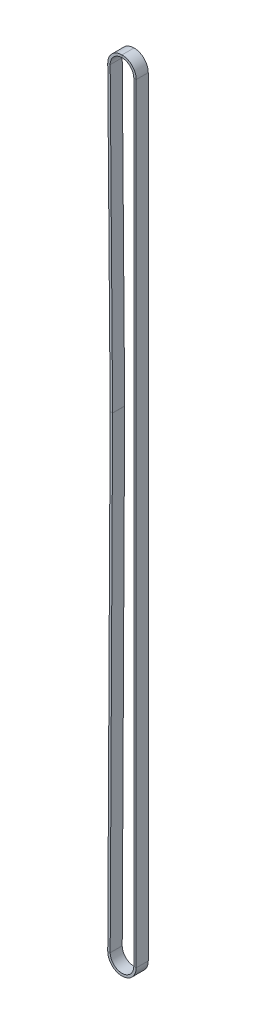
ISO-10303-21;
HEADER;
FILE_DESCRIPTION(('STEP AP214'),'2;1');
FILE_NAME('part.step','',(''),(''),'','','');
FILE_SCHEMA(('AUTOMOTIVE_DESIGN { 1 0 10303 214 1 1 1 1 }'));
ENDSEC;
DATA;
#1=APPLICATION_CONTEXT('core data for automotive mechanical design processes');
#2=APPLICATION_PROTOCOL_DEFINITION('international standard','automotive_design',2000,#1);
#3=PRODUCT_CONTEXT('',#1,'mechanical');
#4=PRODUCT('Part','Part','',(#3));
#5=PRODUCT_RELATED_PRODUCT_CATEGORY('part','',(#4));
#6=PRODUCT_DEFINITION_FORMATION('','',#4);
#7=PRODUCT_DEFINITION_CONTEXT('part definition',#1,'design');
#8=PRODUCT_DEFINITION('design','',#6,#7);
#9=PRODUCT_DEFINITION_SHAPE('','',#8);
#10=(LENGTH_UNIT() NAMED_UNIT(*) SI_UNIT(.MILLI.,.METRE.));
#11=(NAMED_UNIT(*) PLANE_ANGLE_UNIT() SI_UNIT($,.RADIAN.));
#12=(NAMED_UNIT(*) SI_UNIT($,.STERADIAN.) SOLID_ANGLE_UNIT());
#13=UNCERTAINTY_MEASURE_WITH_UNIT(LENGTH_MEASURE(1.E-05),#10,'distance_accuracy_value','');
#14=(GEOMETRIC_REPRESENTATION_CONTEXT(3) GLOBAL_UNCERTAINTY_ASSIGNED_CONTEXT((#13)) GLOBAL_UNIT_ASSIGNED_CONTEXT((#10,
#11,#12)) REPRESENTATION_CONTEXT('',''));
#15=CARTESIAN_POINT('',(0.,0.,0.));
#16=DIRECTION('',(0.,0.,1.));
#17=DIRECTION('',(1.,0.,0.));
#18=AXIS2_PLACEMENT_3D('',#15,#16,#17);
#19=CARTESIAN_POINT('',(-8.7177703192538,470.591298965353,0.));
#20=DIRECTION('',(0.,0.,1.));
#21=DIRECTION('',(1.,0.,0.));
#22=AXIS2_PLACEMENT_3D('',#19,#20,#21);
#23=PLANE('',#22);
#24=CARTESIAN_POINT('',(0.,470.661999990804,0.));
#25=DIRECTION('',(0.,0.,-1.));
#26=DIRECTION('',(-0.999967115657576,-0.00810972277375304,0.));
#27=AXIS2_PLACEMENT_3D('',#24,#25,#26);
#28=CIRCLE('',#27,7.2180570068257);
#29=CARTESIAN_POINT('',(-7.21781964576745,470.603463549513,0.));
#30=VERTEX_POINT('',#29);
#31=CARTESIAN_POINT('',(0.,477.88005699763,0.));
#32=VERTEX_POINT('',#31);
#33=EDGE_CURVE('E188',#30,#32,#28,.T.);
#34=ORIENTED_EDGE('',*,*,#33,.T.);
#35=DIRECTION('',(0.,-1.,0.));
#36=VECTOR('',#35,1.);
#37=CARTESIAN_POINT('',(0.,479.38005699763,0.));
#38=LINE('',#37,#36);
#39=CARTESIAN_POINT('',(0.,479.38005699763,0.));
#40=VERTEX_POINT('',#39);
#41=EDGE_CURVE('E162',#40,#32,#38,.T.);
#42=ORIENTED_EDGE('',*,*,#41,.F.);
#43=CARTESIAN_POINT('',(0.,470.661999990804,0.));
#44=DIRECTION('',(0.,0.,-1.));
#45=DIRECTION('',(-0.999967115657576,-0.00810972277374851,0.));
#46=AXIS2_PLACEMENT_3D('',#43,#44,#45);
#47=CIRCLE('',#46,8.71805700682568);
#48=CARTESIAN_POINT('',(-8.71777031924597,470.591298964389,0.));
#49=VERTEX_POINT('',#48);
#50=EDGE_CURVE('E189',#49,#40,#47,.T.);
#51=ORIENTED_EDGE('',*,*,#50,.F.);
#52=DIRECTION('',(0.999967115647156,0.00810972405866235,0.));
#53=VECTOR('',#52,1.);
#54=CARTESIAN_POINT('',(-8.71777031923815,470.591298963425,0.));
#55=LINE('',#54,#53);
#56=EDGE_CURVE('E281',#49,#30,#55,.T.);
#57=ORIENTED_EDGE('',*,*,#56,.T.);
#58=EDGE_LOOP('',(#34,#42,#51,#57));
#59=FACE_BOUND('',#58,.T.);
#60=ADVANCED_FACE('F33',(#59),#23,.T.);
#61=CARTESIAN_POINT('',(0.,470.661999990804,0.));
#62=DIRECTION('',(0.,0.,-1.));
#63=DIRECTION('',(-1.,0.,0.));
#64=AXIS2_PLACEMENT_3D('',#61,#62,#63);
#65=CYLINDRICAL_SURFACE('',#64,7.2180570068257);
#66=CARTESIAN_POINT('',(0.,470.661999990804,-7.366));
#67=DIRECTION('',(0.,0.,-1.));
#68=DIRECTION('',(-0.999967115657576,-0.00810972277375304,0.));
#69=AXIS2_PLACEMENT_3D('',#66,#67,#68);
#70=CIRCLE('',#69,7.2180570068257);
#71=CARTESIAN_POINT('',(-7.21781964576745,470.603463549513,-7.366));
#72=VERTEX_POINT('',#71);
#73=CARTESIAN_POINT('',(0.,477.88005699763,-7.366));
#74=VERTEX_POINT('',#73);
#75=EDGE_CURVE('E197',#72,#74,#70,.T.);
#76=ORIENTED_EDGE('',*,*,#75,.T.);
#77=DIRECTION('',(0.,0.,-1.));
#78=VECTOR('',#77,1.);
#79=CARTESIAN_POINT('',(0.,477.88005699763,0.));
#80=LINE('',#79,#78);
#81=EDGE_CURVE('E192',#32,#74,#80,.T.);
#82=ORIENTED_EDGE('',*,*,#81,.F.);
#83=ORIENTED_EDGE('',*,*,#33,.F.);
#84=DIRECTION('',(0.,0.,-1.));
#85=VECTOR('',#84,1.);
#86=CARTESIAN_POINT('',(-7.21781964576745,470.603463549513,0.));
#87=LINE('',#86,#85);
#88=EDGE_CURVE('E257',#30,#72,#87,.T.);
#89=ORIENTED_EDGE('',*,*,#88,.T.);
#90=EDGE_LOOP('',(#76,#82,#83,#89));
#91=FACE_BOUND('',#90,.T.);
#92=ADVANCED_FACE('F386',(#91),#65,.F.);
#93=CARTESIAN_POINT('',(-8.7177703192538,470.591298965353,-7.366));
#94=DIRECTION('',(0.,0.,-1.));
#95=DIRECTION('',(-1.,0.,0.));
#96=AXIS2_PLACEMENT_3D('',#93,#94,#95);
#97=PLANE('',#96);
#98=CARTESIAN_POINT('',(0.,470.661999990804,-7.366));
#99=DIRECTION('',(0.,0.,-1.));
#100=DIRECTION('',(-0.999967115657576,-0.00810972277374851,0.));
#101=AXIS2_PLACEMENT_3D('',#98,#99,#100);
#102=CIRCLE('',#101,8.71805700682568);
#103=CARTESIAN_POINT('',(-8.71777031924597,470.591298964389,-7.366));
#104=VERTEX_POINT('',#103);
#105=CARTESIAN_POINT('',(0.,479.38005699763,-7.366));
#106=VERTEX_POINT('',#105);
#107=EDGE_CURVE('E203',#104,#106,#102,.T.);
#108=ORIENTED_EDGE('',*,*,#107,.T.);
#109=DIRECTION('',(0.,1.,0.));
#110=VECTOR('',#109,1.);
#111=CARTESIAN_POINT('',(0.,479.38005699763,-7.366));
#112=LINE('',#111,#110);
#113=EDGE_CURVE('E200',#74,#106,#112,.T.);
#114=ORIENTED_EDGE('',*,*,#113,.F.);
#115=ORIENTED_EDGE('',*,*,#75,.F.);
#116=DIRECTION('',(-0.999967115647156,-0.00810972405866235,0.));
#117=VECTOR('',#116,1.);
#118=CARTESIAN_POINT('',(-8.71777031923815,470.591298963425,-7.366));
#119=LINE('',#118,#117);
#120=EDGE_CURVE('E82',#72,#104,#119,.T.);
#121=ORIENTED_EDGE('',*,*,#120,.T.);
#122=EDGE_LOOP('',(#108,#114,#115,#121));
#123=FACE_BOUND('',#122,.T.);
#124=ADVANCED_FACE('F393',(#123),#97,.T.);
#125=CARTESIAN_POINT('',(0.,470.661999990804,0.));
#126=DIRECTION('',(0.,0.,-1.));
#127=DIRECTION('',(-1.,0.,0.));
#128=AXIS2_PLACEMENT_3D('',#125,#126,#127);
#129=CYLINDRICAL_SURFACE('',#128,8.71805700682568);
#130=DIRECTION('',(0.,0.,1.));
#131=VECTOR('',#130,1.);
#132=CARTESIAN_POINT('',(0.,479.38005699763,0.));
#133=LINE('',#132,#131);
#134=EDGE_CURVE('E37',#106,#40,#133,.T.);
#135=ORIENTED_EDGE('',*,*,#134,.F.);
#136=ORIENTED_EDGE('',*,*,#107,.F.);
#137=DIRECTION('',(0.,0.,1.));
#138=VECTOR('',#137,1.);
#139=CARTESIAN_POINT('',(-8.71777031923815,470.591298963425,0.));
#140=LINE('',#139,#138);
#141=EDGE_CURVE('E204',#104,#49,#140,.T.);
#142=ORIENTED_EDGE('',*,*,#141,.T.);
#143=ORIENTED_EDGE('',*,*,#50,.T.);
#144=EDGE_LOOP('',(#135,#136,#142,#143));
#145=FACE_BOUND('',#144,.T.);
#146=ADVANCED_FACE('F390',(#145),#129,.T.);
#147=CARTESIAN_POINT('',(0.,479.38005699763,0.));
#148=DIRECTION('',(0.,0.,1.));
#149=DIRECTION('',(1.,0.,0.));
#150=AXIS2_PLACEMENT_3D('',#147,#148,#149);
#151=PLANE('',#150);
#152=CARTESIAN_POINT('',(0.,470.661999990804,0.));
#153=DIRECTION('',(0.,0.,-1.));
#154=DIRECTION('',(0.,1.,0.));
#155=AXIS2_PLACEMENT_3D('',#152,#153,#154);
#156=CIRCLE('',#155,7.21805700682571);
#157=CARTESIAN_POINT('',(7.21805700682568,470.66200000008,0.));
#158=VERTEX_POINT('',#157);
#159=EDGE_CURVE('E149',#32,#158,#156,.T.);
#160=ORIENTED_EDGE('',*,*,#159,.T.);
#161=DIRECTION('',(-1.,0.,0.));
#162=VECTOR('',#161,1.);
#163=CARTESIAN_POINT('',(8.71805700682565,470.66200000008,0.));
#164=LINE('',#163,#162);
#165=CARTESIAN_POINT('',(8.71805700682568,470.662000001043,0.));
#166=VERTEX_POINT('',#165);
#167=EDGE_CURVE('E155',#166,#158,#164,.T.);
#168=ORIENTED_EDGE('',*,*,#167,.F.);
#169=CARTESIAN_POINT('',(0.,470.661999990804,0.));
#170=DIRECTION('',(0.,0.,-1.));
#171=DIRECTION('',(0.,1.,0.));
#172=AXIS2_PLACEMENT_3D('',#169,#170,#171);
#173=CIRCLE('',#172,8.71805700682571);
#174=EDGE_CURVE('E163',#40,#166,#173,.T.);
#175=ORIENTED_EDGE('',*,*,#174,.F.);
#176=ORIENTED_EDGE('',*,*,#41,.T.);
#177=EDGE_LOOP('',(#160,#168,#175,#176));
#178=FACE_BOUND('',#177,.T.);
#179=ADVANCED_FACE('F160',(#178),#151,.T.);
#180=CARTESIAN_POINT('',(0.,470.661999990804,0.));
#181=DIRECTION('',(0.,0.,-1.));
#182=DIRECTION('',(-1.,0.,0.));
#183=AXIS2_PLACEMENT_3D('',#180,#181,#182);
#184=CYLINDRICAL_SURFACE('',#183,7.21805700682571);
#185=CARTESIAN_POINT('',(0.,470.661999990804,-7.366));
#186=DIRECTION('',(0.,0.,-1.));
#187=DIRECTION('',(0.,1.,0.));
#188=AXIS2_PLACEMENT_3D('',#185,#186,#187);
#189=CIRCLE('',#188,7.21805700682571);
#190=CARTESIAN_POINT('',(7.21805700682568,470.66200000008,-7.366));
#191=VERTEX_POINT('',#190);
#192=EDGE_CURVE('E69',#74,#191,#189,.T.);
#193=ORIENTED_EDGE('',*,*,#192,.T.);
#194=DIRECTION('',(0.,0.,-1.));
#195=VECTOR('',#194,1.);
#196=CARTESIAN_POINT('',(7.21805700682565,470.66200000008,0.));
#197=LINE('',#196,#195);
#198=EDGE_CURVE('E145',#158,#191,#197,.T.);
#199=ORIENTED_EDGE('',*,*,#198,.F.);
#200=ORIENTED_EDGE('',*,*,#159,.F.);
#201=ORIENTED_EDGE('',*,*,#81,.T.);
#202=EDGE_LOOP('',(#193,#199,#200,#201));
#203=FACE_BOUND('',#202,.T.);
#204=ADVANCED_FACE('F147',(#203),#184,.F.);
#205=CARTESIAN_POINT('',(0.,479.38005699763,-7.366));
#206=DIRECTION('',(0.,0.,-1.));
#207=DIRECTION('',(-1.,0.,0.));
#208=AXIS2_PLACEMENT_3D('',#205,#206,#207);
#209=PLANE('',#208);
#210=CARTESIAN_POINT('',(0.,470.661999990804,-7.366));
#211=DIRECTION('',(0.,0.,-1.));
#212=DIRECTION('',(0.,1.,0.));
#213=AXIS2_PLACEMENT_3D('',#210,#211,#212);
#214=CIRCLE('',#213,8.71805700682571);
#215=CARTESIAN_POINT('',(8.71805700682568,470.662000001043,-7.366));
#216=VERTEX_POINT('',#215);
#217=EDGE_CURVE('E73',#106,#216,#214,.T.);
#218=ORIENTED_EDGE('',*,*,#217,.T.);
#219=DIRECTION('',(1.,0.,0.));
#220=VECTOR('',#219,1.);
#221=CARTESIAN_POINT('',(8.71805700682565,470.66200000008,-7.366));
#222=LINE('',#221,#220);
#223=EDGE_CURVE('E154',#191,#216,#222,.T.);
#224=ORIENTED_EDGE('',*,*,#223,.F.);
#225=ORIENTED_EDGE('',*,*,#192,.F.);
#226=ORIENTED_EDGE('',*,*,#113,.T.);
#227=EDGE_LOOP('',(#218,#224,#225,#226));
#228=FACE_BOUND('',#227,.T.);
#229=ADVANCED_FACE('F397',(#228),#209,.T.);
#230=CARTESIAN_POINT('',(0.,470.661999990804,0.));
#231=DIRECTION('',(0.,0.,-1.));
#232=DIRECTION('',(-1.,0.,0.));
#233=AXIS2_PLACEMENT_3D('',#230,#231,#232);
#234=CYLINDRICAL_SURFACE('',#233,8.71805700682571);
#235=DIRECTION('',(0.,0.,1.));
#236=VECTOR('',#235,1.);
#237=CARTESIAN_POINT('',(8.71805700682565,470.66200000008,0.));
#238=LINE('',#237,#236);
#239=EDGE_CURVE('E52',#216,#166,#238,.T.);
#240=ORIENTED_EDGE('',*,*,#239,.F.);
#241=ORIENTED_EDGE('',*,*,#217,.F.);
#242=ORIENTED_EDGE('',*,*,#134,.T.);
#243=ORIENTED_EDGE('',*,*,#174,.T.);
#244=EDGE_LOOP('',(#240,#241,#242,#243));
#245=FACE_BOUND('',#244,.T.);
#246=ADVANCED_FACE('F35',(#245),#234,.T.);
#247=CARTESIAN_POINT('',(8.71805700682565,1.51755995553002E-12,0.));
#248=DIRECTION('',(0.,0.,1.));
#249=DIRECTION('',(1.,0.,0.));
#250=AXIS2_PLACEMENT_3D('',#247,#248,#249);
#251=PLANE('',#250);
#252=CARTESIAN_POINT('',(0.,0.,0.));
#253=DIRECTION('',(0.,0.,-1.));
#254=DIRECTION('',(1.,1.73409178692898E-13,0.));
#255=AXIS2_PLACEMENT_3D('',#252,#253,#254);
#256=CIRCLE('',#255,7.21805700682565);
#257=CARTESIAN_POINT('',(7.21805700682565,1.4432899320127E-12,0.));
#258=VERTEX_POINT('',#257);
#259=CARTESIAN_POINT('',(-7.21795942082731,0.0375333594966495,0.));
#260=VERTEX_POINT('',#259);
#261=EDGE_CURVE('E277',#258,#260,#256,.T.);
#262=ORIENTED_EDGE('',*,*,#261,.T.);
#263=DIRECTION('',(0.999986480295425,-0.00519992561171665,0.));
#264=VECTOR('',#263,1.);
#265=CARTESIAN_POINT('',(-8.7179391412705,0.0453332479142263,0.));
#266=LINE('',#265,#264);
#267=CARTESIAN_POINT('',(-8.71793914127045,0.0453332479142241,0.));
#268=VERTEX_POINT('',#267);
#269=EDGE_CURVE('E301',#268,#260,#266,.T.);
#270=ORIENTED_EDGE('',*,*,#269,.F.);
#271=CARTESIAN_POINT('',(0.,0.,0.));
#272=DIRECTION('',(0.,0.,-1.));
#273=DIRECTION('',(1.,1.74070891523406E-13,0.));
#274=AXIS2_PLACEMENT_3D('',#271,#272,#273);
#275=CIRCLE('',#274,8.71805700682565);
#276=CARTESIAN_POINT('',(8.71805700682565,1.4432899320127E-12,0.));
#277=VERTEX_POINT('',#276);
#278=EDGE_CURVE('E231',#277,#268,#275,.T.);
#279=ORIENTED_EDGE('',*,*,#278,.F.);
#280=DIRECTION('',(-1.,0.,0.));
#281=VECTOR('',#280,1.);
#282=CARTESIAN_POINT('',(8.71805700682565,1.35949636541586E-12,0.));
#283=LINE('',#282,#281);
#284=EDGE_CURVE('E172',#277,#258,#283,.T.);
#285=ORIENTED_EDGE('',*,*,#284,.T.);
#286=EDGE_LOOP('',(#262,#270,#279,#285));
#287=FACE_BOUND('',#286,.T.);
#288=ADVANCED_FACE('F307',(#287),#251,.T.);
#289=CARTESIAN_POINT('',(0.,0.,0.));
#290=DIRECTION('',(0.,0.,-1.));
#291=DIRECTION('',(-1.,0.,0.));
#292=AXIS2_PLACEMENT_3D('',#289,#290,#291);
#293=CYLINDRICAL_SURFACE('',#292,7.21805700682565);
#294=CARTESIAN_POINT('',(0.,0.,-7.366));
#295=DIRECTION('',(0.,0.,-1.));
#296=DIRECTION('',(1.,1.73409178692898E-13,0.));
#297=AXIS2_PLACEMENT_3D('',#294,#295,#296);
#298=CIRCLE('',#297,7.21805700682565);
#299=CARTESIAN_POINT('',(7.21805700682565,1.4432899320127E-12,-7.366));
#300=VERTEX_POINT('',#299);
#301=CARTESIAN_POINT('',(-7.21795942082731,0.0375333594966495,-7.366));
#302=VERTEX_POINT('',#301);
#303=EDGE_CURVE('E252',#300,#302,#298,.T.);
#304=ORIENTED_EDGE('',*,*,#303,.T.);
#305=DIRECTION('',(0.,0.,-1.));
#306=VECTOR('',#305,1.);
#307=CARTESIAN_POINT('',(-7.21795942082737,0.0375333594966514,0.));
#308=LINE('',#307,#306);
#309=EDGE_CURVE('E274',#260,#302,#308,.T.);
#310=ORIENTED_EDGE('',*,*,#309,.F.);
#311=ORIENTED_EDGE('',*,*,#261,.F.);
#312=DIRECTION('',(0.,0.,-1.));
#313=VECTOR('',#312,1.);
#314=CARTESIAN_POINT('',(7.21805700682565,1.35959312915985E-12,0.));
#315=LINE('',#314,#313);
#316=EDGE_CURVE('E177',#258,#300,#315,.T.);
#317=ORIENTED_EDGE('',*,*,#316,.T.);
#318=EDGE_LOOP('',(#304,#310,#311,#317));
#319=FACE_BOUND('',#318,.T.);
#320=ADVANCED_FACE('F325',(#319),#293,.F.);
#321=CARTESIAN_POINT('',(8.71805700682565,1.51755995553002E-12,-7.366));
#322=DIRECTION('',(0.,0.,-1.));
#323=DIRECTION('',(-1.,0.,0.));
#324=AXIS2_PLACEMENT_3D('',#321,#322,#323);
#325=PLANE('',#324);
#326=CARTESIAN_POINT('',(0.,0.,-7.366));
#327=DIRECTION('',(0.,0.,-1.));
#328=DIRECTION('',(1.,1.74070891523406E-13,0.));
#329=AXIS2_PLACEMENT_3D('',#326,#327,#328);
#330=CIRCLE('',#329,8.71805700682565);
#331=CARTESIAN_POINT('',(8.71805700682565,1.4432899320127E-12,-7.366));
#332=VERTEX_POINT('',#331);
#333=CARTESIAN_POINT('',(-8.71793914127045,0.0453332479142241,-7.366));
#334=VERTEX_POINT('',#333);
#335=EDGE_CURVE('E226',#332,#334,#330,.T.);
#336=ORIENTED_EDGE('',*,*,#335,.T.);
#337=DIRECTION('',(-0.999986480295425,0.00519992561171665,0.));
#338=VECTOR('',#337,1.);
#339=CARTESIAN_POINT('',(-8.7179391412705,0.0453332479142263,-7.366));
#340=LINE('',#339,#338);
#341=EDGE_CURVE('E249',#302,#334,#340,.T.);
#342=ORIENTED_EDGE('',*,*,#341,.F.);
#343=ORIENTED_EDGE('',*,*,#303,.F.);
#344=DIRECTION('',(1.,0.,0.));
#345=VECTOR('',#344,1.);
#346=CARTESIAN_POINT('',(8.71805700682565,1.35949636541586E-12,-7.366));
#347=LINE('',#346,#345);
#348=EDGE_CURVE('E230',#300,#332,#347,.T.);
#349=ORIENTED_EDGE('',*,*,#348,.T.);
#350=EDGE_LOOP('',(#336,#342,#343,#349));
#351=FACE_BOUND('',#350,.T.);
#352=ADVANCED_FACE('F320',(#351),#325,.T.);
#353=CARTESIAN_POINT('',(0.,0.,0.));
#354=DIRECTION('',(0.,0.,-1.));
#355=DIRECTION('',(-1.,0.,0.));
#356=AXIS2_PLACEMENT_3D('',#353,#354,#355);
#357=CYLINDRICAL_SURFACE('',#356,8.71805700682565);
#358=DIRECTION('',(0.,0.,1.));
#359=VECTOR('',#358,1.);
#360=CARTESIAN_POINT('',(-8.7179391412705,0.0453332479142263,0.));
#361=LINE('',#360,#359);
#362=EDGE_CURVE('E223',#334,#268,#361,.T.);
#363=ORIENTED_EDGE('',*,*,#362,.F.);
#364=ORIENTED_EDGE('',*,*,#335,.F.);
#365=DIRECTION('',(0.,0.,1.));
#366=VECTOR('',#365,1.);
#367=CARTESIAN_POINT('',(8.71805700682565,1.35949636541586E-12,0.));
#368=LINE('',#367,#366);
#369=EDGE_CURVE('E228',#332,#277,#368,.T.);
#370=ORIENTED_EDGE('',*,*,#369,.T.);
#371=ORIENTED_EDGE('',*,*,#278,.T.);
#372=EDGE_LOOP('',(#363,#364,#370,#371));
#373=FACE_BOUND('',#372,.T.);
#374=ADVANCED_FACE('F313',(#373),#357,.T.);
#375=CARTESIAN_POINT('',(-8.7179391412705,0.0453332479142276,0.));
#376=DIRECTION('',(0.,0.,1.));
#377=DIRECTION('',(1.,0.,0.));
#378=AXIS2_PLACEMENT_3D('',#375,#376,#377);
#379=PLANE('',#378);
#380=DIRECTION('',(0.0051999256117167,0.999986480295425,0.));
#381=VECTOR('',#380,1.);
#382=CARTESIAN_POINT('',(-7.21795942082737,0.0375333594966522,0.));
#383=LINE('',#382,#381);
#384=CARTESIAN_POINT('',(-5.7270359040868,286.753819557073,0.));
#385=VERTEX_POINT('',#384);
#386=EDGE_CURVE('E271',#260,#385,#383,.T.);
#387=ORIENTED_EDGE('',*,*,#386,.T.);
#388=DIRECTION('',(0.999986480295425,-0.00519992561171676,0.));
#389=VECTOR('',#388,1.);
#390=CARTESIAN_POINT('',(-7.22701562452993,286.761619445491,0.));
#391=LINE('',#390,#389);
#392=CARTESIAN_POINT('',(-7.22701562452994,286.761619445491,0.));
#393=VERTEX_POINT('',#392);
#394=EDGE_CURVE('E294',#393,#385,#391,.T.);
#395=ORIENTED_EDGE('',*,*,#394,.F.);
#396=DIRECTION('',(0.0051999256117167,0.999986480295425,0.));
#397=VECTOR('',#396,1.);
#398=CARTESIAN_POINT('',(-8.7179391412705,0.0453332479142276,0.));
#399=LINE('',#398,#397);
#400=EDGE_CURVE('E227',#268,#393,#399,.T.);
#401=ORIENTED_EDGE('',*,*,#400,.F.);
#402=ORIENTED_EDGE('',*,*,#269,.T.);
#403=EDGE_LOOP('',(#387,#395,#401,#402));
#404=FACE_BOUND('',#403,.T.);
#405=ADVANCED_FACE('F332',(#404),#379,.T.);
#406=CARTESIAN_POINT('',(-7.21795942082737,0.0375333594966522,0.));
#407=DIRECTION('',(0.999986480295425,-0.0051999256117167,0.));
#408=DIRECTION('',(0.0051999256117167,0.999986480295425,0.));
#409=AXIS2_PLACEMENT_3D('',#406,#407,#408);
#410=PLANE('',#409);
#411=DIRECTION('',(0.0051999256117167,0.999986480295425,0.));
#412=VECTOR('',#411,1.);
#413=CARTESIAN_POINT('',(-7.21795942082737,0.0375333594966522,-7.366));
#414=LINE('',#413,#412);
#415=CARTESIAN_POINT('',(-5.7270359040868,286.753819557073,-7.366));
#416=VERTEX_POINT('',#415);
#417=EDGE_CURVE('E246',#302,#416,#414,.T.);
#418=ORIENTED_EDGE('',*,*,#417,.T.);
#419=DIRECTION('',(0.,0.,-1.));
#420=VECTOR('',#419,1.);
#421=CARTESIAN_POINT('',(-5.7270359040868,286.753819557073,0.));
#422=LINE('',#421,#420);
#423=EDGE_CURVE('E268',#385,#416,#422,.T.);
#424=ORIENTED_EDGE('',*,*,#423,.F.);
#425=ORIENTED_EDGE('',*,*,#386,.F.);
#426=ORIENTED_EDGE('',*,*,#309,.T.);
#427=EDGE_LOOP('',(#418,#424,#425,#426));
#428=FACE_BOUND('',#427,.T.);
#429=ADVANCED_FACE('F328',(#428),#410,.T.);
#430=CARTESIAN_POINT('',(-8.7179391412705,0.0453332479142276,-7.366));
#431=DIRECTION('',(0.,0.,-1.));
#432=DIRECTION('',(-1.,0.,0.));
#433=AXIS2_PLACEMENT_3D('',#430,#431,#432);
#434=PLANE('',#433);
#435=DIRECTION('',(0.0051999256117167,0.999986480295425,0.));
#436=VECTOR('',#435,1.);
#437=CARTESIAN_POINT('',(-8.7179391412705,0.0453332479142276,-7.366));
#438=LINE('',#437,#436);
#439=CARTESIAN_POINT('',(-7.22701562452994,286.761619445491,-7.366));
#440=VERTEX_POINT('',#439);
#441=EDGE_CURVE('E221',#334,#440,#438,.T.);
#442=ORIENTED_EDGE('',*,*,#441,.T.);
#443=DIRECTION('',(-0.999986480295425,0.00519992561171676,0.));
#444=VECTOR('',#443,1.);
#445=CARTESIAN_POINT('',(-7.22701562452993,286.761619445491,-7.366));
#446=LINE('',#445,#444);
#447=EDGE_CURVE('E243',#416,#440,#446,.T.);
#448=ORIENTED_EDGE('',*,*,#447,.F.);
#449=ORIENTED_EDGE('',*,*,#417,.F.);
#450=ORIENTED_EDGE('',*,*,#341,.T.);
#451=EDGE_LOOP('',(#442,#448,#449,#450));
#452=FACE_BOUND('',#451,.T.);
#453=ADVANCED_FACE('F344',(#452),#434,.T.);
#454=CARTESIAN_POINT('',(-8.7179391412705,0.0453332479142276,0.));
#455=DIRECTION('',(-0.999986480295425,0.0051999256117167,0.));
#456=DIRECTION('',(-0.0051999256117167,-0.999986480295425,0.));
#457=AXIS2_PLACEMENT_3D('',#454,#455,#456);
#458=PLANE('',#457);
#459=DIRECTION('',(0.,0.,1.));
#460=VECTOR('',#459,1.);
#461=CARTESIAN_POINT('',(-7.22701562452993,286.761619445491,0.));
#462=LINE('',#461,#460);
#463=EDGE_CURVE('E218',#440,#393,#462,.T.);
#464=ORIENTED_EDGE('',*,*,#463,.F.);
#465=ORIENTED_EDGE('',*,*,#441,.F.);
#466=ORIENTED_EDGE('',*,*,#362,.T.);
#467=ORIENTED_EDGE('',*,*,#400,.T.);
#468=EDGE_LOOP('',(#464,#465,#466,#467));
#469=FACE_BOUND('',#468,.T.);
#470=ADVANCED_FACE('F341',(#469),#458,.T.);
#471=CARTESIAN_POINT('',(-7.22701562452993,286.761619445491,0.));
#472=DIRECTION('',(0.,0.,1.));
#473=DIRECTION('',(1.,0.,0.));
#474=AXIS2_PLACEMENT_3D('',#471,#472,#473);
#475=PLANE('',#474);
#476=CARTESIAN_POINT('',(-8.38200000003336,286.767625359524,0.));
#477=DIRECTION('',(0.,0.,1.));
#478=DIRECTION('',(0.999986480295425,-0.00519992561174214,0.));
#479=AXIS2_PLACEMENT_3D('',#476,#477,#478);
#480=CIRCLE('',#479,2.65499999076209);
#481=CARTESIAN_POINT('',(-5.72708731722777,286.789156676825,0.));
#482=VERTEX_POINT('',#481);
#483=EDGE_CURVE('E265',#385,#482,#480,.T.);
#484=ORIENTED_EDGE('',*,*,#483,.T.);
#485=DIRECTION('',(0.999967115647156,0.00810972405866504,0.));
#486=VECTOR('',#485,1.);
#487=CARTESIAN_POINT('',(-7.22703799069846,286.776992090737,0.));
#488=LINE('',#487,#486);
#489=CARTESIAN_POINT('',(-7.2270379906985,286.776992090737,0.));
#490=VERTEX_POINT('',#489);
#491=EDGE_CURVE('E287',#490,#482,#488,.T.);
#492=ORIENTED_EDGE('',*,*,#491,.F.);
#493=CARTESIAN_POINT('',(-8.38200000003336,286.767625359524,0.));
#494=DIRECTION('',(0.,0.,1.));
#495=DIRECTION('',(0.999986480295425,-0.0051999256117122,0.));
#496=AXIS2_PLACEMENT_3D('',#493,#494,#495);
#497=CIRCLE('',#496,1.15499999076209);
#498=EDGE_CURVE('E222',#393,#490,#497,.T.);
#499=ORIENTED_EDGE('',*,*,#498,.F.);
#500=ORIENTED_EDGE('',*,*,#394,.T.);
#501=EDGE_LOOP('',(#484,#492,#499,#500));
#502=FACE_BOUND('',#501,.T.);
#503=ADVANCED_FACE('F334',(#502),#475,.T.);
#504=CARTESIAN_POINT('',(-8.38200000003336,286.767625359524,0.));
#505=DIRECTION('',(0.,0.,1.));
#506=DIRECTION('',(1.,0.,0.));
#507=AXIS2_PLACEMENT_3D('',#504,#505,#506);
#508=CYLINDRICAL_SURFACE('',#507,2.65499999076209);
#509=CARTESIAN_POINT('',(-8.38200000003336,286.767625359524,-7.366));
#510=DIRECTION('',(0.,0.,1.));
#511=DIRECTION('',(0.999986480295425,-0.00519992561174214,0.));
#512=AXIS2_PLACEMENT_3D('',#509,#510,#511);
#513=CIRCLE('',#512,2.65499999076209);
#514=CARTESIAN_POINT('',(-5.72708731722777,286.789156676825,-7.366));
#515=VERTEX_POINT('',#514);
#516=EDGE_CURVE('E240',#416,#515,#513,.T.);
#517=ORIENTED_EDGE('',*,*,#516,.T.);
#518=DIRECTION('',(0.,0.,-1.));
#519=VECTOR('',#518,1.);
#520=CARTESIAN_POINT('',(-5.72708731722776,286.789156676825,0.));
#521=LINE('',#520,#519);
#522=EDGE_CURVE('E262',#482,#515,#521,.T.);
#523=ORIENTED_EDGE('',*,*,#522,.F.);
#524=ORIENTED_EDGE('',*,*,#483,.F.);
#525=ORIENTED_EDGE('',*,*,#423,.T.);
#526=EDGE_LOOP('',(#517,#523,#524,#525));
#527=FACE_BOUND('',#526,.T.);
#528=ADVANCED_FACE('F350',(#527),#508,.T.);
#529=CARTESIAN_POINT('',(-7.22701562452993,286.761619445491,-7.366));
#530=DIRECTION('',(0.,0.,-1.));
#531=DIRECTION('',(-1.,0.,0.));
#532=AXIS2_PLACEMENT_3D('',#529,#530,#531);
#533=PLANE('',#532);
#534=CARTESIAN_POINT('',(-8.38200000003336,286.767625359524,-7.366));
#535=DIRECTION('',(0.,0.,1.));
#536=DIRECTION('',(0.999986480295425,-0.0051999256117122,0.));
#537=AXIS2_PLACEMENT_3D('',#534,#535,#536);
#538=CIRCLE('',#537,1.15499999076209);
#539=CARTESIAN_POINT('',(-7.2270379906985,286.776992090737,-7.366));
#540=VERTEX_POINT('',#539);
#541=EDGE_CURVE('E216',#440,#540,#538,.T.);
#542=ORIENTED_EDGE('',*,*,#541,.T.);
#543=DIRECTION('',(-0.999967115647156,-0.00810972405866504,0.));
#544=VECTOR('',#543,1.);
#545=CARTESIAN_POINT('',(-7.22703799069846,286.776992090737,-7.366));
#546=LINE('',#545,#544);
#547=EDGE_CURVE('E237',#515,#540,#546,.T.);
#548=ORIENTED_EDGE('',*,*,#547,.F.);
#549=ORIENTED_EDGE('',*,*,#516,.F.);
#550=ORIENTED_EDGE('',*,*,#447,.T.);
#551=EDGE_LOOP('',(#542,#548,#549,#550));
#552=FACE_BOUND('',#551,.T.);
#553=ADVANCED_FACE('F346',(#552),#533,.T.);
#554=CARTESIAN_POINT('',(-8.38200000003336,286.767625359524,0.));
#555=DIRECTION('',(0.,0.,1.));
#556=DIRECTION('',(1.,0.,0.));
#557=AXIS2_PLACEMENT_3D('',#554,#555,#556);
#558=CYLINDRICAL_SURFACE('',#557,1.15499999076209);
#559=DIRECTION('',(0.,0.,1.));
#560=VECTOR('',#559,1.);
#561=CARTESIAN_POINT('',(-7.22703799069846,286.776992090737,0.));
#562=LINE('',#561,#560);
#563=EDGE_CURVE('E213',#540,#490,#562,.T.);
#564=ORIENTED_EDGE('',*,*,#563,.F.);
#565=ORIENTED_EDGE('',*,*,#541,.F.);
#566=ORIENTED_EDGE('',*,*,#463,.T.);
#567=ORIENTED_EDGE('',*,*,#498,.T.);
#568=EDGE_LOOP('',(#564,#565,#566,#567));
#569=FACE_BOUND('',#568,.T.);
#570=ADVANCED_FACE('F339',(#569),#558,.F.);
#571=CARTESIAN_POINT('',(-7.22703799069846,286.776992090737,0.));
#572=DIRECTION('',(0.,0.,1.));
#573=DIRECTION('',(1.,0.,0.));
#574=AXIS2_PLACEMENT_3D('',#571,#572,#573);
#575=PLANE('',#574);
#576=DIRECTION('',(-0.00810972405866242,0.999967115647156,0.));
#577=VECTOR('',#576,1.);
#578=CARTESIAN_POINT('',(-5.72708731722776,286.789156676825,0.));
#579=LINE('',#578,#577);
#580=EDGE_CURVE('E259',#482,#30,#579,.T.);
#581=ORIENTED_EDGE('',*,*,#580,.T.);
#582=ORIENTED_EDGE('',*,*,#56,.F.);
#583=DIRECTION('',(-0.00810972405866242,0.999967115647156,0.));
#584=VECTOR('',#583,1.);
#585=CARTESIAN_POINT('',(-7.22703799069846,286.776992090737,0.));
#586=LINE('',#585,#584);
#587=EDGE_CURVE('E217',#490,#49,#586,.T.);
#588=ORIENTED_EDGE('',*,*,#587,.F.);
#589=ORIENTED_EDGE('',*,*,#491,.T.);
#590=EDGE_LOOP('',(#581,#582,#588,#589));
#591=FACE_BOUND('',#590,.T.);
#592=ADVANCED_FACE('F356',(#591),#575,.T.);
#593=CARTESIAN_POINT('',(-5.72708731722776,286.789156676825,0.));
#594=DIRECTION('',(0.999967115647156,0.00810972405866242,0.));
#595=DIRECTION('',(-0.00810972405866242,0.999967115647156,0.));
#596=AXIS2_PLACEMENT_3D('',#593,#594,#595);
#597=PLANE('',#596);
#598=DIRECTION('',(-0.00810972405866242,0.999967115647156,0.));
#599=VECTOR('',#598,1.);
#600=CARTESIAN_POINT('',(-5.72708731722776,286.789156676825,-7.366));
#601=LINE('',#600,#599);
#602=EDGE_CURVE('E234',#515,#72,#601,.T.);
#603=ORIENTED_EDGE('',*,*,#602,.T.);
#604=ORIENTED_EDGE('',*,*,#88,.F.);
#605=ORIENTED_EDGE('',*,*,#580,.F.);
#606=ORIENTED_EDGE('',*,*,#522,.T.);
#607=EDGE_LOOP('',(#603,#604,#605,#606));
#608=FACE_BOUND('',#607,.T.);
#609=ADVANCED_FACE('F352',(#608),#597,.T.);
#610=CARTESIAN_POINT('',(-7.22703799069846,286.776992090737,-7.366));
#611=DIRECTION('',(0.,0.,-1.));
#612=DIRECTION('',(-1.,0.,0.));
#613=AXIS2_PLACEMENT_3D('',#610,#611,#612);
#614=PLANE('',#613);
#615=DIRECTION('',(-0.00810972405866242,0.999967115647156,0.));
#616=VECTOR('',#615,1.);
#617=CARTESIAN_POINT('',(-7.22703799069846,286.776992090737,-7.366));
#618=LINE('',#617,#616);
#619=EDGE_CURVE('E205',#540,#104,#618,.T.);
#620=ORIENTED_EDGE('',*,*,#619,.T.);
#621=ORIENTED_EDGE('',*,*,#120,.F.);
#622=ORIENTED_EDGE('',*,*,#602,.F.);
#623=ORIENTED_EDGE('',*,*,#547,.T.);
#624=EDGE_LOOP('',(#620,#621,#622,#623));
#625=FACE_BOUND('',#624,.T.);
#626=ADVANCED_FACE('F360',(#625),#614,.T.);
#627=CARTESIAN_POINT('',(-7.22703799069846,286.776992090737,0.));
#628=DIRECTION('',(-0.999967115647156,-0.00810972405866242,0.));
#629=DIRECTION('',(0.00810972405866242,-0.999967115647156,0.));
#630=AXIS2_PLACEMENT_3D('',#627,#628,#629);
#631=PLANE('',#630);
#632=ORIENTED_EDGE('',*,*,#141,.F.);
#633=ORIENTED_EDGE('',*,*,#619,.F.);
#634=ORIENTED_EDGE('',*,*,#563,.T.);
#635=ORIENTED_EDGE('',*,*,#587,.T.);
#636=EDGE_LOOP('',(#632,#633,#634,#635));
#637=FACE_BOUND('',#636,.T.);
#638=ADVANCED_FACE('F358',(#637),#631,.T.);
#639=CARTESIAN_POINT('',(8.71805700682565,470.66200000008,0.));
#640=DIRECTION('',(1.,0.,0.));
#641=DIRECTION('',(0.,1.,0.));
#642=AXIS2_PLACEMENT_3D('',#639,#640,#641);
#643=PLANE('',#642);
#644=DIRECTION('',(0.,-1.,0.));
#645=VECTOR('',#644,1.);
#646=CARTESIAN_POINT('',(8.71805700682565,470.66200000008,0.));
#647=LINE('',#646,#645);
#648=EDGE_CURVE('E171',#166,#277,#647,.T.);
#649=ORIENTED_EDGE('',*,*,#648,.T.);
#650=ORIENTED_EDGE('',*,*,#369,.F.);
#651=DIRECTION('',(0.,-1.,0.));
#652=VECTOR('',#651,1.);
#653=CARTESIAN_POINT('',(8.71805700682565,470.66200000008,-7.366));
#654=LINE('',#653,#652);
#655=EDGE_CURVE('E11',#216,#332,#654,.T.);
#656=ORIENTED_EDGE('',*,*,#655,.F.);
#657=ORIENTED_EDGE('',*,*,#239,.T.);
#658=EDGE_LOOP('',(#649,#650,#656,#657));
#659=FACE_BOUND('',#658,.T.);
#660=ADVANCED_FACE('F316',(#659),#643,.T.);
#661=CARTESIAN_POINT('',(8.71805700682565,470.66200000008,-7.366));
#662=DIRECTION('',(0.,0.,-1.));
#663=DIRECTION('',(-1.,0.,0.));
#664=AXIS2_PLACEMENT_3D('',#661,#662,#663);
#665=PLANE('',#664);
#666=ORIENTED_EDGE('',*,*,#655,.T.);
#667=ORIENTED_EDGE('',*,*,#348,.F.);
#668=DIRECTION('',(0.,-1.,0.));
#669=VECTOR('',#668,1.);
#670=CARTESIAN_POINT('',(7.21805700682565,470.66200000008,-7.366));
#671=LINE('',#670,#669);
#672=EDGE_CURVE('E43',#191,#300,#671,.T.);
#673=ORIENTED_EDGE('',*,*,#672,.F.);
#674=ORIENTED_EDGE('',*,*,#223,.T.);
#675=EDGE_LOOP('',(#666,#667,#673,#674));
#676=FACE_BOUND('',#675,.T.);
#677=ADVANCED_FACE('F323',(#676),#665,.T.);
#678=CARTESIAN_POINT('',(7.21805700682565,470.66200000008,0.));
#679=DIRECTION('',(-1.,0.,0.));
#680=DIRECTION('',(0.,-1.,0.));
#681=AXIS2_PLACEMENT_3D('',#678,#679,#680);
#682=PLANE('',#681);
#683=ORIENTED_EDGE('',*,*,#672,.T.);
#684=ORIENTED_EDGE('',*,*,#316,.F.);
#685=DIRECTION('',(0.,-1.,0.));
#686=VECTOR('',#685,1.);
#687=CARTESIAN_POINT('',(7.21805700682565,470.66200000008,0.));
#688=LINE('',#687,#686);
#689=EDGE_CURVE('E169',#158,#258,#688,.T.);
#690=ORIENTED_EDGE('',*,*,#689,.F.);
#691=ORIENTED_EDGE('',*,*,#198,.T.);
#692=EDGE_LOOP('',(#683,#684,#690,#691));
#693=FACE_BOUND('',#692,.T.);
#694=ADVANCED_FACE('F175',(#693),#682,.T.);
#695=CARTESIAN_POINT('',(8.71805700682565,470.66200000008,0.));
#696=DIRECTION('',(0.,0.,1.));
#697=DIRECTION('',(1.,0.,0.));
#698=AXIS2_PLACEMENT_3D('',#695,#696,#697);
#699=PLANE('',#698);
#700=ORIENTED_EDGE('',*,*,#689,.T.);
#701=ORIENTED_EDGE('',*,*,#284,.F.);
#702=ORIENTED_EDGE('',*,*,#648,.F.);
#703=ORIENTED_EDGE('',*,*,#167,.T.);
#704=EDGE_LOOP('',(#700,#701,#702,#703));
#705=FACE_BOUND('',#704,.T.);
#706=ADVANCED_FACE('F167',(#705),#699,.T.);
#707=CLOSED_SHELL('',(#60,#92,#124,#146,#179,#204,#229,#246,#288,#320,#352,#374,#405,#429,#453,
#470,#503,#528,#553,#570,#592,#609,#626,#638,#660,#677,#694,#706));
#708=MANIFOLD_SOLID_BREP('B2',#707);
#709=ADVANCED_BREP_SHAPE_REPRESENTATION('',(#18,#708),#14);
#710=SHAPE_DEFINITION_REPRESENTATION(#9,#709);
ENDSEC;
END-ISO-10303-21;
